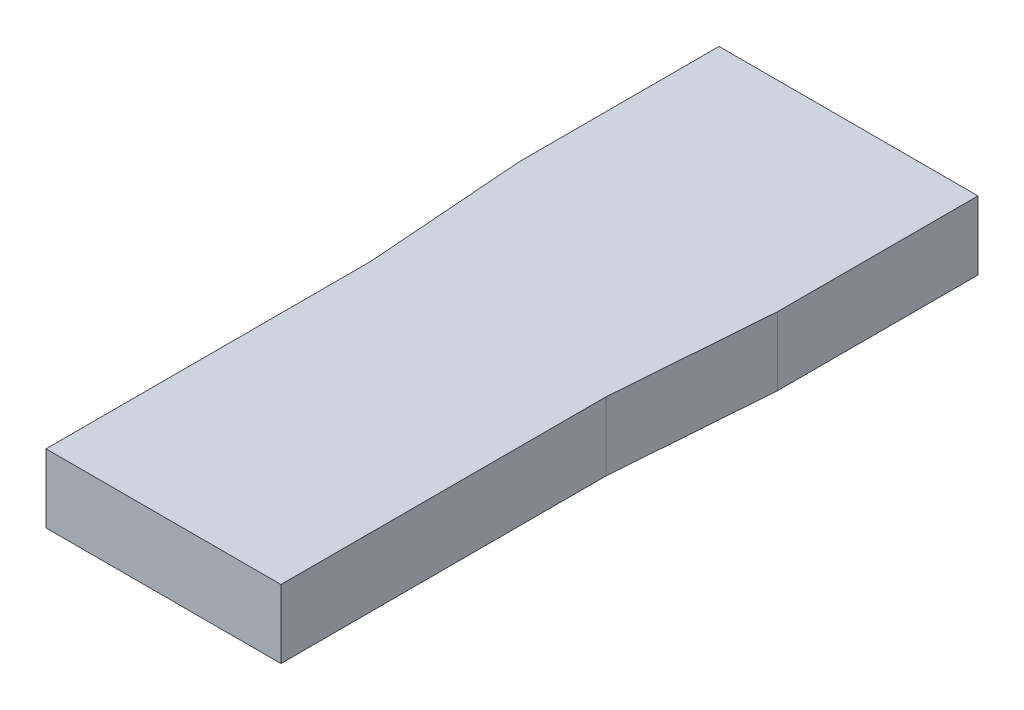
ISO-10303-21;
HEADER;
FILE_DESCRIPTION(('STEP AP214'),'2;1');
FILE_NAME('part.step','',(''),(''),'','','');
FILE_SCHEMA(('AUTOMOTIVE_DESIGN { 1 0 10303 214 1 1 1 1 }'));
ENDSEC;
DATA;
#1=APPLICATION_CONTEXT('core data for automotive mechanical design processes');
#2=APPLICATION_PROTOCOL_DEFINITION('international standard','automotive_design',2000,#1);
#3=PRODUCT_CONTEXT('',#1,'mechanical');
#4=PRODUCT('Part','Part','',(#3));
#5=PRODUCT_RELATED_PRODUCT_CATEGORY('part','',(#4));
#6=PRODUCT_DEFINITION_FORMATION('','',#4);
#7=PRODUCT_DEFINITION_CONTEXT('part definition',#1,'design');
#8=PRODUCT_DEFINITION('design','',#6,#7);
#9=PRODUCT_DEFINITION_SHAPE('','',#8);
#10=(LENGTH_UNIT() NAMED_UNIT(*) SI_UNIT(.MILLI.,.METRE.));
#11=(NAMED_UNIT(*) PLANE_ANGLE_UNIT() SI_UNIT($,.RADIAN.));
#12=(NAMED_UNIT(*) SI_UNIT($,.STERADIAN.) SOLID_ANGLE_UNIT());
#13=UNCERTAINTY_MEASURE_WITH_UNIT(LENGTH_MEASURE(1.E-05),#10,'distance_accuracy_value','');
#14=(GEOMETRIC_REPRESENTATION_CONTEXT(3) GLOBAL_UNCERTAINTY_ASSIGNED_CONTEXT((#13)) GLOBAL_UNIT_ASSIGNED_CONTEXT((#10,
#11,#12)) REPRESENTATION_CONTEXT('',''));
#15=CARTESIAN_POINT('',(0.,0.,0.));
#16=DIRECTION('',(0.,0.,1.));
#17=DIRECTION('',(1.,0.,0.));
#18=AXIS2_PLACEMENT_3D('',#15,#16,#17);
#19=CARTESIAN_POINT('',(5.67,3.,15.));
#20=DIRECTION('',(-1.,0.,0.));
#21=DIRECTION('',(0.,0.,1.));
#22=AXIS2_PLACEMENT_3D('',#19,#20,#21);
#23=PLANE('',#22);
#24=DIRECTION('',(0.,1.,0.));
#25=VECTOR('',#24,1.);
#26=CARTESIAN_POINT('',(5.67,0.,-6.23));
#27=LINE('',#26,#25);
#28=CARTESIAN_POINT('',(5.67,0.,-6.23));
#29=VERTEX_POINT('',#28);
#30=CARTESIAN_POINT('',(5.67,3.,-6.22999999999988));
#31=VERTEX_POINT('',#30);
#32=EDGE_CURVE('E66',#29,#31,#27,.T.);
#33=ORIENTED_EDGE('',*,*,#32,.F.);
#34=DIRECTION('',(0.,0.,-1.));
#35=VECTOR('',#34,1.);
#36=CARTESIAN_POINT('',(5.67,0.,15.));
#37=LINE('',#36,#35);
#38=CARTESIAN_POINT('',(5.67,0.,-15.));
#39=VERTEX_POINT('',#38);
#40=EDGE_CURVE('E105',#29,#39,#37,.T.);
#41=ORIENTED_EDGE('',*,*,#40,.T.);
#42=DIRECTION('',(0.,-1.,0.));
#43=VECTOR('',#42,1.);
#44=CARTESIAN_POINT('',(5.67,3.,-15.));
#45=LINE('',#44,#43);
#46=CARTESIAN_POINT('',(5.67,3.,-15.));
#47=VERTEX_POINT('',#46);
#48=EDGE_CURVE('E11',#47,#39,#45,.T.);
#49=ORIENTED_EDGE('',*,*,#48,.F.);
#50=DIRECTION('',(0.,0.,-1.));
#51=VECTOR('',#50,1.);
#52=CARTESIAN_POINT('',(5.67,3.,15.));
#53=LINE('',#52,#51);
#54=EDGE_CURVE('E82',#31,#47,#53,.T.);
#55=ORIENTED_EDGE('',*,*,#54,.F.);
#56=EDGE_LOOP('',(#33,#41,#49,#55));
#57=FACE_BOUND('',#56,.T.);
#58=ADVANCED_FACE('F33',(#57),#23,.F.);
#59=CARTESIAN_POINT('',(-5.67,3.,15.));
#60=DIRECTION('',(0.,0.,-1.));
#61=DIRECTION('',(-1.,0.,0.));
#62=AXIS2_PLACEMENT_3D('',#59,#60,#61);
#63=PLANE('',#62);
#64=DIRECTION('',(0.,1.,0.));
#65=VECTOR('',#64,1.);
#66=CARTESIAN_POINT('',(5.145,0.,15.));
#67=LINE('',#66,#65);
#68=CARTESIAN_POINT('',(5.145,0.,15.));
#69=VERTEX_POINT('',#68);
#70=CARTESIAN_POINT('',(5.145,3.,15.));
#71=VERTEX_POINT('',#70);
#72=EDGE_CURVE('E87',#69,#71,#67,.T.);
#73=ORIENTED_EDGE('',*,*,#72,.T.);
#74=DIRECTION('',(1.,0.,0.));
#75=VECTOR('',#74,1.);
#76=CARTESIAN_POINT('',(-5.67,3.,15.));
#77=LINE('',#76,#75);
#78=CARTESIAN_POINT('',(-5.145,3.,15.));
#79=VERTEX_POINT('',#78);
#80=EDGE_CURVE('E103',#79,#71,#77,.T.);
#81=ORIENTED_EDGE('',*,*,#80,.F.);
#82=DIRECTION('',(0.,1.,0.));
#83=VECTOR('',#82,1.);
#84=CARTESIAN_POINT('',(-5.145,0.,15.));
#85=LINE('',#84,#83);
#86=CARTESIAN_POINT('',(-5.145,0.,15.));
#87=VERTEX_POINT('',#86);
#88=EDGE_CURVE('E129',#87,#79,#85,.T.);
#89=ORIENTED_EDGE('',*,*,#88,.F.);
#90=DIRECTION('',(1.,0.,0.));
#91=VECTOR('',#90,1.);
#92=CARTESIAN_POINT('',(-5.67,0.,15.));
#93=LINE('',#92,#91);
#94=EDGE_CURVE('E90',#87,#69,#93,.T.);
#95=ORIENTED_EDGE('',*,*,#94,.T.);
#96=EDGE_LOOP('',(#73,#81,#89,#95));
#97=FACE_BOUND('',#96,.T.);
#98=ADVANCED_FACE('F186',(#97),#63,.F.);
#99=CARTESIAN_POINT('',(0.,3.,0.));
#100=DIRECTION('',(0.,-1.,0.));
#101=DIRECTION('',(0.,0.,-1.));
#102=AXIS2_PLACEMENT_3D('',#99,#100,#101);
#103=PLANE('',#102);
#104=DIRECTION('',(0.,0.,1.));
#105=VECTOR('',#104,1.);
#106=CARTESIAN_POINT('',(5.145,3.,0.));
#107=LINE('',#106,#105);
#108=CARTESIAN_POINT('',(5.145,3.,0.770000000000029));
#109=VERTEX_POINT('',#108);
#110=EDGE_CURVE('E86',#109,#71,#107,.T.);
#111=ORIENTED_EDGE('',*,*,#110,.F.);
#112=DIRECTION('',(-0.0747899482416344,0.,0.997199309888456));
#113=VECTOR('',#112,1.);
#114=CARTESIAN_POINT('',(5.66999999999998,3.,-6.22999999999977));
#115=LINE('',#114,#113);
#116=EDGE_CURVE('E36',#109,#31,#115,.F.);
#117=ORIENTED_EDGE('',*,*,#116,.T.);
#118=ORIENTED_EDGE('',*,*,#54,.T.);
#119=DIRECTION('',(-1.,0.,0.));
#120=VECTOR('',#119,1.);
#121=CARTESIAN_POINT('',(-5.67,3.,-15.));
#122=LINE('',#121,#120);
#123=CARTESIAN_POINT('',(-5.67,3.,-15.));
#124=VERTEX_POINT('',#123);
#125=EDGE_CURVE('E89',#47,#124,#122,.T.);
#126=ORIENTED_EDGE('',*,*,#125,.T.);
#127=DIRECTION('',(0.,0.,1.));
#128=VECTOR('',#127,1.);
#129=CARTESIAN_POINT('',(-5.67,3.,15.));
#130=LINE('',#129,#128);
#131=CARTESIAN_POINT('',(-5.67,3.,-6.22999999999999));
#132=VERTEX_POINT('',#131);
#133=EDGE_CURVE('E92',#124,#132,#130,.T.);
#134=ORIENTED_EDGE('',*,*,#133,.T.);
#135=DIRECTION('',(-0.0747899482416344,0.,-0.997199309888456));
#136=VECTOR('',#135,1.);
#137=CARTESIAN_POINT('',(-5.145,3.,0.769999999999999));
#138=LINE('',#137,#136);
#139=CARTESIAN_POINT('',(-5.145,3.,0.76999999999999));
#140=VERTEX_POINT('',#139);
#141=EDGE_CURVE('E108',#140,#132,#138,.T.);
#142=ORIENTED_EDGE('',*,*,#141,.F.);
#143=DIRECTION('',(0.,0.,1.));
#144=VECTOR('',#143,1.);
#145=CARTESIAN_POINT('',(-5.145,3.,0.));
#146=LINE('',#145,#144);
#147=EDGE_CURVE('E98',#140,#79,#146,.T.);
#148=ORIENTED_EDGE('',*,*,#147,.T.);
#149=ORIENTED_EDGE('',*,*,#80,.T.);
#150=EDGE_LOOP('',(#111,#117,#118,#126,#134,#142,#148,#149));
#151=FACE_BOUND('',#150,.T.);
#152=ADVANCED_FACE('F79',(#151),#103,.F.);
#153=CARTESIAN_POINT('',(0.,0.,0.));
#154=DIRECTION('',(0.,-1.,0.));
#155=DIRECTION('',(0.,0.,-1.));
#156=AXIS2_PLACEMENT_3D('',#153,#154,#155);
#157=PLANE('',#156);
#158=DIRECTION('',(0.0747899482416344,0.,-0.997199309888456));
#159=VECTOR('',#158,1.);
#160=CARTESIAN_POINT('',(5.145,0.,0.769999999999999));
#161=LINE('',#160,#159);
#162=CARTESIAN_POINT('',(5.145,0.,0.769999999999999));
#163=VERTEX_POINT('',#162);
#164=EDGE_CURVE('E69',#163,#29,#161,.T.);
#165=ORIENTED_EDGE('',*,*,#164,.F.);
#166=DIRECTION('',(0.,0.,-1.));
#167=VECTOR('',#166,1.);
#168=CARTESIAN_POINT('',(5.145,0.,15.));
#169=LINE('',#168,#167);
#170=EDGE_CURVE('E74',#69,#163,#169,.T.);
#171=ORIENTED_EDGE('',*,*,#170,.F.);
#172=ORIENTED_EDGE('',*,*,#94,.F.);
#173=DIRECTION('',(0.,0.,-1.));
#174=VECTOR('',#173,1.);
#175=CARTESIAN_POINT('',(-5.145,0.,15.));
#176=LINE('',#175,#174);
#177=CARTESIAN_POINT('',(-5.145,0.,0.769999999999999));
#178=VERTEX_POINT('',#177);
#179=EDGE_CURVE('E136',#87,#178,#176,.T.);
#180=ORIENTED_EDGE('',*,*,#179,.T.);
#181=DIRECTION('',(-0.0747899482416344,0.,-0.997199309888456));
#182=VECTOR('',#181,1.);
#183=CARTESIAN_POINT('',(-5.145,0.,0.769999999999999));
#184=LINE('',#183,#182);
#185=CARTESIAN_POINT('',(-5.67,0.,-6.23));
#186=VERTEX_POINT('',#185);
#187=EDGE_CURVE('E133',#178,#186,#184,.T.);
#188=ORIENTED_EDGE('',*,*,#187,.T.);
#189=DIRECTION('',(0.,0.,1.));
#190=VECTOR('',#189,1.);
#191=CARTESIAN_POINT('',(-5.67,0.,15.));
#192=LINE('',#191,#190);
#193=CARTESIAN_POINT('',(-5.67,0.,-15.));
#194=VERTEX_POINT('',#193);
#195=EDGE_CURVE('E95',#194,#186,#192,.T.);
#196=ORIENTED_EDGE('',*,*,#195,.F.);
#197=DIRECTION('',(-1.,0.,0.));
#198=VECTOR('',#197,1.);
#199=CARTESIAN_POINT('',(-5.67,0.,-15.));
#200=LINE('',#199,#198);
#201=EDGE_CURVE('E107',#39,#194,#200,.T.);
#202=ORIENTED_EDGE('',*,*,#201,.F.);
#203=ORIENTED_EDGE('',*,*,#40,.F.);
#204=EDGE_LOOP('',(#165,#171,#172,#180,#188,#196,#202,#203));
#205=FACE_BOUND('',#204,.T.);
#206=ADVANCED_FACE('F150',(#205),#157,.T.);
#207=CARTESIAN_POINT('',(-5.67,3.,-15.));
#208=DIRECTION('',(0.,0.,1.));
#209=DIRECTION('',(1.,0.,0.));
#210=AXIS2_PLACEMENT_3D('',#207,#208,#209);
#211=PLANE('',#210);
#212=ORIENTED_EDGE('',*,*,#201,.T.);
#213=DIRECTION('',(0.,-1.,0.));
#214=VECTOR('',#213,1.);
#215=CARTESIAN_POINT('',(-5.67,3.,-15.));
#216=LINE('',#215,#214);
#217=EDGE_CURVE('E42',#124,#194,#216,.T.);
#218=ORIENTED_EDGE('',*,*,#217,.F.);
#219=ORIENTED_EDGE('',*,*,#125,.F.);
#220=ORIENTED_EDGE('',*,*,#48,.T.);
#221=EDGE_LOOP('',(#212,#218,#219,#220));
#222=FACE_BOUND('',#221,.T.);
#223=ADVANCED_FACE('F173',(#222),#211,.F.);
#224=CARTESIAN_POINT('',(-5.67,3.,15.));
#225=DIRECTION('',(1.,0.,0.));
#226=DIRECTION('',(0.,0.,-1.));
#227=AXIS2_PLACEMENT_3D('',#224,#225,#226);
#228=PLANE('',#227);
#229=ORIENTED_EDGE('',*,*,#195,.T.);
#230=DIRECTION('',(0.,1.,0.));
#231=VECTOR('',#230,1.);
#232=CARTESIAN_POINT('',(-5.67,0.,-6.23));
#233=LINE('',#232,#231);
#234=EDGE_CURVE('E121',#186,#132,#233,.T.);
#235=ORIENTED_EDGE('',*,*,#234,.T.);
#236=ORIENTED_EDGE('',*,*,#133,.F.);
#237=ORIENTED_EDGE('',*,*,#217,.T.);
#238=EDGE_LOOP('',(#229,#235,#236,#237));
#239=FACE_BOUND('',#238,.T.);
#240=ADVANCED_FACE('F174',(#239),#228,.F.);
#241=CARTESIAN_POINT('',(-5.145,0.,0.769999999999999));
#242=DIRECTION('',(0.997199309888456,0.,-0.0747899482416344));
#243=DIRECTION('',(-0.0747899482416344,0.,-0.997199309888456));
#244=AXIS2_PLACEMENT_3D('',#241,#242,#243);
#245=PLANE('',#244);
#246=ORIENTED_EDGE('',*,*,#234,.F.);
#247=ORIENTED_EDGE('',*,*,#187,.F.);
#248=DIRECTION('',(0.,1.,0.));
#249=VECTOR('',#248,1.);
#250=CARTESIAN_POINT('',(-5.145,0.,0.769999999999999));
#251=LINE('',#250,#249);
#252=EDGE_CURVE('E125',#178,#140,#251,.T.);
#253=ORIENTED_EDGE('',*,*,#252,.T.);
#254=ORIENTED_EDGE('',*,*,#141,.T.);
#255=EDGE_LOOP('',(#246,#247,#253,#254));
#256=FACE_BOUND('',#255,.T.);
#257=ADVANCED_FACE('F176',(#256),#245,.F.);
#258=CARTESIAN_POINT('',(-5.145,0.,15.));
#259=DIRECTION('',(1.,0.,0.));
#260=DIRECTION('',(0.,0.,-1.));
#261=AXIS2_PLACEMENT_3D('',#258,#259,#260);
#262=PLANE('',#261);
#263=ORIENTED_EDGE('',*,*,#252,.F.);
#264=ORIENTED_EDGE('',*,*,#179,.F.);
#265=ORIENTED_EDGE('',*,*,#88,.T.);
#266=ORIENTED_EDGE('',*,*,#147,.F.);
#267=EDGE_LOOP('',(#263,#264,#265,#266));
#268=FACE_BOUND('',#267,.T.);
#269=ADVANCED_FACE('F182',(#268),#262,.F.);
#270=CARTESIAN_POINT('',(5.145,0.,15.));
#271=DIRECTION('',(1.,0.,0.));
#272=DIRECTION('',(0.,0.,-1.));
#273=AXIS2_PLACEMENT_3D('',#270,#271,#272);
#274=PLANE('',#273);
#275=ORIENTED_EDGE('',*,*,#110,.T.);
#276=ORIENTED_EDGE('',*,*,#72,.F.);
#277=ORIENTED_EDGE('',*,*,#170,.T.);
#278=DIRECTION('',(0.,1.,0.));
#279=VECTOR('',#278,1.);
#280=CARTESIAN_POINT('',(5.145,0.,0.769999999999999));
#281=LINE('',#280,#279);
#282=EDGE_CURVE('E51',#163,#109,#281,.T.);
#283=ORIENTED_EDGE('',*,*,#282,.T.);
#284=EDGE_LOOP('',(#275,#276,#277,#283));
#285=FACE_BOUND('',#284,.T.);
#286=ADVANCED_FACE('F147',(#285),#274,.T.);
#287=CARTESIAN_POINT('',(5.145,0.,0.769999999999999));
#288=DIRECTION('',(0.997199309888456,0.,0.0747899482416344));
#289=DIRECTION('',(0.0747899482416344,0.,-0.997199309888456));
#290=AXIS2_PLACEMENT_3D('',#287,#288,#289);
#291=PLANE('',#290);
#292=ORIENTED_EDGE('',*,*,#116,.F.);
#293=ORIENTED_EDGE('',*,*,#282,.F.);
#294=ORIENTED_EDGE('',*,*,#164,.T.);
#295=ORIENTED_EDGE('',*,*,#32,.T.);
#296=EDGE_LOOP('',(#292,#293,#294,#295));
#297=FACE_BOUND('',#296,.T.);
#298=ADVANCED_FACE('F67',(#297),#291,.T.);
#299=CLOSED_SHELL('',(#58,#98,#152,#206,#223,#240,#257,#269,#286,#298));
#300=MANIFOLD_SOLID_BREP('B2',#299);
#301=ADVANCED_BREP_SHAPE_REPRESENTATION('',(#18,#300),#14);
#302=SHAPE_DEFINITION_REPRESENTATION(#9,#301);
ENDSEC;
END-ISO-10303-21;
